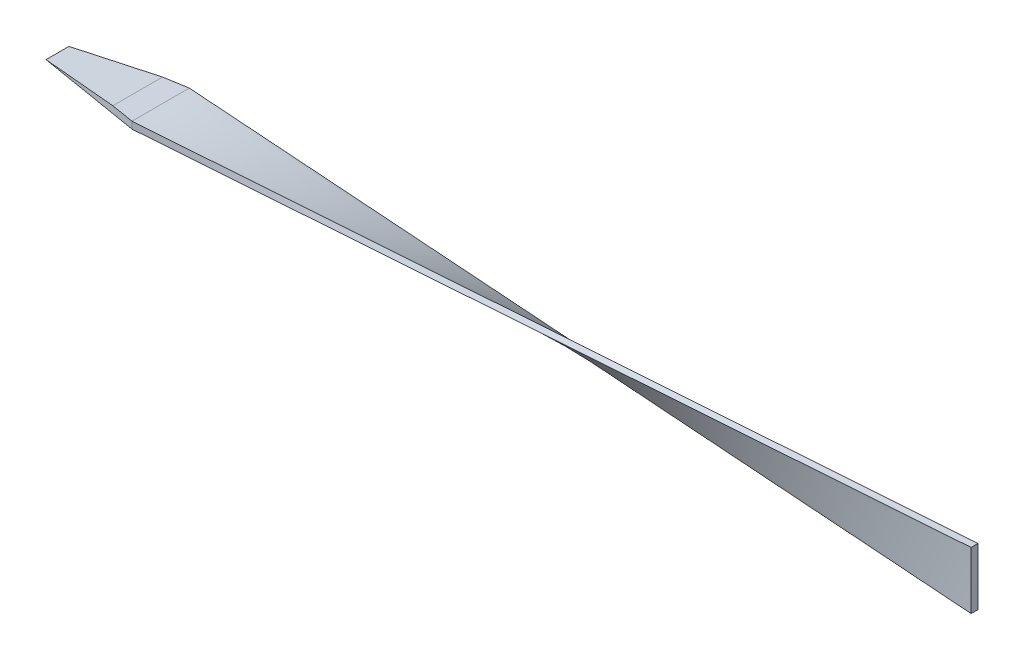
ISO-10303-21;
HEADER;
FILE_DESCRIPTION(('STEP AP214'),'2;1');
FILE_NAME('part.step','',(''),(''),'','','');
FILE_SCHEMA(('AUTOMOTIVE_DESIGN { 1 0 10303 214 1 1 1 1 }'));
ENDSEC;
DATA;
#1=APPLICATION_CONTEXT('core data for automotive mechanical design processes');
#2=APPLICATION_PROTOCOL_DEFINITION('international standard','automotive_design',2000,#1);
#3=PRODUCT_CONTEXT('',#1,'mechanical');
#4=PRODUCT('Part','Part','',(#3));
#5=PRODUCT_RELATED_PRODUCT_CATEGORY('part','',(#4));
#6=PRODUCT_DEFINITION_FORMATION('','',#4);
#7=PRODUCT_DEFINITION_CONTEXT('part definition',#1,'design');
#8=PRODUCT_DEFINITION('design','',#6,#7);
#9=PRODUCT_DEFINITION_SHAPE('','',#8);
#10=(LENGTH_UNIT() NAMED_UNIT(*) SI_UNIT(.MILLI.,.METRE.));
#11=(NAMED_UNIT(*) PLANE_ANGLE_UNIT() SI_UNIT($,.RADIAN.));
#12=(NAMED_UNIT(*) SI_UNIT($,.STERADIAN.) SOLID_ANGLE_UNIT());
#13=UNCERTAINTY_MEASURE_WITH_UNIT(LENGTH_MEASURE(1.E-05),#10,'distance_accuracy_value','');
#14=(GEOMETRIC_REPRESENTATION_CONTEXT(3) GLOBAL_UNCERTAINTY_ASSIGNED_CONTEXT((#13)) GLOBAL_UNIT_ASSIGNED_CONTEXT((#10,
#11,#12)) REPRESENTATION_CONTEXT('',''));
#15=CARTESIAN_POINT('',(0.,0.,0.));
#16=DIRECTION('',(0.,0.,1.));
#17=DIRECTION('',(1.,0.,0.));
#18=AXIS2_PLACEMENT_3D('',#15,#16,#17);
#19=CARTESIAN_POINT('',(0.,0.06,0.));
#20=DIRECTION('',(0.,1.,0.));
#21=DIRECTION('',(0.,0.,1.));
#22=AXIS2_PLACEMENT_3D('',#19,#20,#21);
#23=PLANE('',#22);
#24=DIRECTION('',(0.,0.,1.));
#25=VECTOR('',#24,1.);
#26=CARTESIAN_POINT('',(-7.1,0.06,0.));
#27=LINE('',#26,#25);
#28=CARTESIAN_POINT('',(-7.10000000000001,0.0600000000000002,-0.249999999999999));
#29=VERTEX_POINT('',#28);
#30=CARTESIAN_POINT('',(-7.10000000000002,0.0599999999999997,0.249999999999998));
#31=VERTEX_POINT('',#30);
#32=EDGE_CURVE('E122',#29,#31,#27,.T.);
#33=ORIENTED_EDGE('',*,*,#32,.F.);
#34=DIRECTION('',(0.986393923832144,0.,-0.164398987305357));
#35=VECTOR('',#34,1.);
#36=CARTESIAN_POINT('',(-8.,0.06,-0.0999999999999998));
#37=LINE('',#36,#35);
#38=CARTESIAN_POINT('',(-7.30000000000001,0.0599999999999994,-0.216666666666664));
#39=VERTEX_POINT('',#38);
#40=EDGE_CURVE('E110',#39,#29,#37,.T.);
#41=ORIENTED_EDGE('',*,*,#40,.F.);
#42=DIRECTION('',(0.,0.,1.));
#43=VECTOR('',#42,1.);
#44=CARTESIAN_POINT('',(-7.3,0.06,-1.));
#45=LINE('',#44,#43);
#46=CARTESIAN_POINT('',(-7.3,0.06,0.216666666666666));
#47=VERTEX_POINT('',#46);
#48=EDGE_CURVE('E120',#39,#47,#45,.T.);
#49=ORIENTED_EDGE('',*,*,#48,.T.);
#50=DIRECTION('',(0.986393923832144,0.,0.164398987305357));
#51=VECTOR('',#50,1.);
#52=CARTESIAN_POINT('',(-8.,0.06,0.0999999999999998));
#53=LINE('',#52,#51);
#54=EDGE_CURVE('E71',#47,#31,#53,.T.);
#55=ORIENTED_EDGE('',*,*,#54,.T.);
#56=EDGE_LOOP('',(#33,#41,#49,#55));
#57=FACE_BOUND('',#56,.T.);
#58=ADVANCED_FACE('F51',(#57),#23,.T.);
#59=CARTESIAN_POINT('',(0.,0.,0.));
#60=DIRECTION('',(0.,1.,0.));
#61=DIRECTION('',(0.,0.,1.));
#62=AXIS2_PLACEMENT_3D('',#59,#60,#61);
#63=PLANE('',#62);
#64=DIRECTION('',(0.986393923832144,0.,-0.164398987305357));
#65=VECTOR('',#64,1.);
#66=CARTESIAN_POINT('',(-8.,0.,-0.0999999999999998));
#67=LINE('',#66,#65);
#68=CARTESIAN_POINT('',(-8.,0.,-0.0999999999999998));
#69=VERTEX_POINT('',#68);
#70=CARTESIAN_POINT('',(-7.1,0.,-0.249999999999999));
#71=VERTEX_POINT('',#70);
#72=EDGE_CURVE('E113',#69,#71,#67,.T.);
#73=ORIENTED_EDGE('',*,*,#72,.T.);
#74=DIRECTION('',(0.,0.,1.));
#75=VECTOR('',#74,1.);
#76=CARTESIAN_POINT('',(-7.1,0.,0.));
#77=LINE('',#76,#75);
#78=CARTESIAN_POINT('',(-7.10000000000001,0.,0.249999999999999));
#79=VERTEX_POINT('',#78);
#80=EDGE_CURVE('E143',#71,#79,#77,.T.);
#81=ORIENTED_EDGE('',*,*,#80,.T.);
#82=DIRECTION('',(0.986393923832144,0.,0.164398987305357));
#83=VECTOR('',#82,1.);
#84=CARTESIAN_POINT('',(-8.,0.,0.0999999999999998));
#85=LINE('',#84,#83);
#86=CARTESIAN_POINT('',(-8.,0.,0.0999999999999998));
#87=VERTEX_POINT('',#86);
#88=EDGE_CURVE('E89',#87,#79,#85,.T.);
#89=ORIENTED_EDGE('',*,*,#88,.F.);
#90=DIRECTION('',(0.,0.,-1.));
#91=VECTOR('',#90,1.);
#92=CARTESIAN_POINT('',(-8.,0.,0.));
#93=LINE('',#92,#91);
#94=EDGE_CURVE('E127',#87,#69,#93,.T.);
#95=ORIENTED_EDGE('',*,*,#94,.T.);
#96=EDGE_LOOP('',(#73,#81,#89,#95));
#97=FACE_BOUND('',#96,.T.);
#98=ADVANCED_FACE('F53',(#97),#63,.F.);
#99=CARTESIAN_POINT('',(-7.3,0.06,-1.));
#100=DIRECTION('',(-0.0854011413464358,0.996346649041751,0.));
#101=DIRECTION('',(-0.996346649041751,-0.0854011413464358,0.));
#102=AXIS2_PLACEMENT_3D('',#99,#100,#101);
#103=PLANE('',#102);
#104=ORIENTED_EDGE('',*,*,#48,.F.);
#105=DIRECTION('',(-0.982887157648091,-0.0842474706555507,0.163814526274681));
#106=VECTOR('',#105,1.);
#107=CARTESIAN_POINT('',(-7.17387456461259,0.0708107516046353,-0.237687572564568));
#108=LINE('',#107,#106);
#109=EDGE_CURVE('E13',#39,#69,#108,.T.);
#110=ORIENTED_EDGE('',*,*,#109,.T.);
#111=ORIENTED_EDGE('',*,*,#94,.F.);
#112=DIRECTION('',(-0.982887157648091,-0.0842474706555507,-0.163814526274681));
#113=VECTOR('',#112,1.);
#114=CARTESIAN_POINT('',(-7.49589695283577,0.043208832614077,0.184017174527372));
#115=LINE('',#114,#113);
#116=EDGE_CURVE('E62',#47,#87,#115,.T.);
#117=ORIENTED_EDGE('',*,*,#116,.F.);
#118=EDGE_LOOP('',(#104,#110,#111,#117));
#119=FACE_BOUND('',#118,.T.);
#120=ADVANCED_FACE('F125',(#119),#103,.T.);
#121=CARTESIAN_POINT('',(-8.,0.06,0.0999999999999998));
#122=DIRECTION('',(0.164398987305357,0.,-0.986393923832144));
#123=DIRECTION('',(-0.986393923832144,0.,-0.164398987305357));
#124=AXIS2_PLACEMENT_3D('',#121,#122,#123);
#125=PLANE('',#124);
#126=ORIENTED_EDGE('',*,*,#116,.T.);
#127=ORIENTED_EDGE('',*,*,#88,.T.);
#128=DIRECTION('',(0.,1.,0.));
#129=VECTOR('',#128,1.);
#130=CARTESIAN_POINT('',(-7.1,0.06,0.249999999999999));
#131=LINE('',#130,#129);
#132=EDGE_CURVE('E55',#31,#79,#131,.F.);
#133=ORIENTED_EDGE('',*,*,#132,.F.);
#134=ORIENTED_EDGE('',*,*,#54,.F.);
#135=EDGE_LOOP('',(#126,#127,#133,#134));
#136=FACE_BOUND('',#135,.T.);
#137=ADVANCED_FACE('F261',(#136),#125,.F.);
#138=CARTESIAN_POINT('',(-8.,0.06,-0.0999999999999998));
#139=DIRECTION('',(-0.164398987305357,0.,-0.986393923832144));
#140=DIRECTION('',(-0.986393923832144,0.,0.164398987305357));
#141=AXIS2_PLACEMENT_3D('',#138,#139,#140);
#142=PLANE('',#141);
#143=ORIENTED_EDGE('',*,*,#40,.T.);
#144=DIRECTION('',(0.,1.,0.));
#145=VECTOR('',#144,1.);
#146=CARTESIAN_POINT('',(-7.1,0.06,-0.249999999999999));
#147=LINE('',#146,#145);
#148=EDGE_CURVE('E146',#29,#71,#147,.F.);
#149=ORIENTED_EDGE('',*,*,#148,.T.);
#150=ORIENTED_EDGE('',*,*,#72,.F.);
#151=ORIENTED_EDGE('',*,*,#109,.F.);
#152=EDGE_LOOP('',(#143,#149,#150,#151));
#153=FACE_BOUND('',#152,.T.);
#154=ADVANCED_FACE('F109',(#153),#142,.T.);
#155=CARTESIAN_POINT('',(0.,0.,0.));
#156=DIRECTION('',(-1.,0.,0.));
#157=DIRECTION('',(0.,0.,1.));
#158=AXIS2_PLACEMENT_3D('',#155,#156,#157);
#159=PLANE('',#158);
#160=DIRECTION('',(0.,-1.,0.));
#161=VECTOR('',#160,1.);
#162=CARTESIAN_POINT('',(0.,0.28,-0.03));
#163=LINE('',#162,#161);
#164=CARTESIAN_POINT('',(0.,0.28,-0.03));
#165=VERTEX_POINT('',#164);
#166=CARTESIAN_POINT('',(0.,-0.22,-0.03));
#167=VERTEX_POINT('',#166);
#168=EDGE_CURVE('E181',#165,#167,#163,.T.);
#169=ORIENTED_EDGE('',*,*,#168,.F.);
#170=DIRECTION('',(0.,0.,-1.));
#171=VECTOR('',#170,1.);
#172=CARTESIAN_POINT('',(0.,0.28,-0.03));
#173=LINE('',#172,#171);
#174=CARTESIAN_POINT('',(0.,0.28,0.03));
#175=VERTEX_POINT('',#174);
#176=EDGE_CURVE('E177',#175,#165,#173,.T.);
#177=ORIENTED_EDGE('',*,*,#176,.F.);
#178=DIRECTION('',(0.,1.,0.));
#179=VECTOR('',#178,1.);
#180=CARTESIAN_POINT('',(0.,0.28,0.03));
#181=LINE('',#180,#179);
#182=CARTESIAN_POINT('',(0.,-0.22,0.03));
#183=VERTEX_POINT('',#182);
#184=EDGE_CURVE('E237',#183,#175,#181,.T.);
#185=ORIENTED_EDGE('',*,*,#184,.F.);
#186=DIRECTION('',(0.,0.,1.));
#187=VECTOR('',#186,1.);
#188=CARTESIAN_POINT('',(0.,-0.22,-0.03));
#189=LINE('',#188,#187);
#190=EDGE_CURVE('E98',#167,#183,#189,.T.);
#191=ORIENTED_EDGE('',*,*,#190,.F.);
#192=EDGE_LOOP('',(#169,#177,#185,#191));
#193=FACE_BOUND('',#192,.T.);
#194=ADVANCED_FACE('F201',(#193),#159,.F.);
#195=CARTESIAN_POINT('',(0.,0.28,-0.03));
#196=CARTESIAN_POINT('',(-7.1,0.06,0.249999999999999));
#197=CARTESIAN_POINT('',(0.,0.196666666666667,-0.03));
#198=CARTESIAN_POINT('',(-7.1,0.06,0.166666666666666));
#199=CARTESIAN_POINT('',(0.,0.113333333333334,-0.03));
#200=CARTESIAN_POINT('',(-7.1,0.06,0.083333333333333));
#201=CARTESIAN_POINT('',(0.,-0.0533333333333329,-0.03));
#202=CARTESIAN_POINT('',(-7.1,0.06,-0.0833333333333332));
#203=CARTESIAN_POINT('',(0.,-0.136666666666666,-0.03));
#204=CARTESIAN_POINT('',(-7.1,0.06,-0.166666666666666));
#205=CARTESIAN_POINT('',(0.,-0.22,-0.03));
#206=CARTESIAN_POINT('',(-7.1,0.06,-0.249999999999999));
#207=B_SPLINE_SURFACE_WITH_KNOTS('',3,1,((#195,#196),(#197,#198),(#199,#200),(#201,#202),(#203,
#204),(#205,#206)),.UNSPECIFIED.,.F.,.F.,.F.,(4,2,4),(2,2),(0.,0.5,1.),(0.,1.),.UNSPECIFIED.);
#208=DIRECTION('',(-0.998744680735361,0.0393871141698452,-0.0309470182763069));
#209=VECTOR('',#208,1.);
#210=CARTESIAN_POINT('',(-3.55,-0.08,-0.14));
#211=LINE('',#210,#209);
#212=EDGE_CURVE('E164',#167,#29,#211,.T.);
#213=DIRECTION('',(0.998744680735361,0.030947018276307,-0.0393871141698451));
#214=VECTOR('',#213,1.);
#215=CARTESIAN_POINT('',(-3.55,0.17,0.11));
#216=LINE('',#215,#214);
#217=EDGE_CURVE('E174',#31,#165,#216,.T.);
#218=ORIENTED_EDGE('',*,*,#168,.T.);
#219=ORIENTED_EDGE('',*,*,#212,.T.);
#220=ORIENTED_EDGE('',*,*,#32,.T.);
#221=ORIENTED_EDGE('',*,*,#217,.T.);
#222=EDGE_LOOP('',(#218,#219,#220,#221));
#223=FACE_BOUND('',#222,.T.);
#224=ADVANCED_FACE('F188',(#223),#207,.T.);
#225=CARTESIAN_POINT('',(0.,-0.22,-0.03));
#226=CARTESIAN_POINT('',(-7.1,0.06,-0.249999999999999));
#227=CARTESIAN_POINT('',(0.,-0.22,-0.02));
#228=CARTESIAN_POINT('',(-7.1,0.05,-0.249999999999999));
#229=CARTESIAN_POINT('',(0.,-0.22,-0.01));
#230=CARTESIAN_POINT('',(-7.1,0.04,-0.249999999999999));
#231=CARTESIAN_POINT('',(0.,-0.22,0.00999999999999999));
#232=CARTESIAN_POINT('',(-7.1,0.02,-0.249999999999999));
#233=CARTESIAN_POINT('',(0.,-0.22,0.02));
#234=CARTESIAN_POINT('',(-7.1,0.00999999999999998,-0.249999999999999));
#235=CARTESIAN_POINT('',(0.,-0.22,0.03));
#236=CARTESIAN_POINT('',(-7.1,0.,-0.249999999999999));
#237=B_SPLINE_SURFACE_WITH_KNOTS('',3,1,((#225,#226),(#227,#228),(#229,#230),(#231,#232),(#233,
#234),(#235,#236)),.UNSPECIFIED.,.F.,.F.,.F.,(4,2,4),(2,2),(0.,0.5,1.),(0.,1.),.UNSPECIFIED.);
#238=DIRECTION('',(-0.998744680735361,0.0309470182763069,-0.0393871141698451));
#239=VECTOR('',#238,1.);
#240=CARTESIAN_POINT('',(-3.55,-0.11,-0.11));
#241=LINE('',#240,#239);
#242=EDGE_CURVE('E156',#183,#71,#241,.T.);
#243=ORIENTED_EDGE('',*,*,#190,.T.);
#244=ORIENTED_EDGE('',*,*,#242,.T.);
#245=ORIENTED_EDGE('',*,*,#148,.F.);
#246=ORIENTED_EDGE('',*,*,#212,.F.);
#247=EDGE_LOOP('',(#243,#244,#245,#246));
#248=FACE_BOUND('',#247,.T.);
#249=ADVANCED_FACE('F200',(#248),#237,.T.);
#250=CARTESIAN_POINT('',(0.,0.28,0.03));
#251=CARTESIAN_POINT('',(-7.1,0.,0.249999999999999));
#252=CARTESIAN_POINT('',(0.,0.28,0.02));
#253=CARTESIAN_POINT('',(-7.1,0.01,0.249999999999999));
#254=CARTESIAN_POINT('',(0.,0.28,0.00999999999999999));
#255=CARTESIAN_POINT('',(-7.1,0.02,0.249999999999999));
#256=CARTESIAN_POINT('',(0.,0.28,-0.01));
#257=CARTESIAN_POINT('',(-7.1,0.04,0.249999999999999));
#258=CARTESIAN_POINT('',(0.,0.28,-0.02));
#259=CARTESIAN_POINT('',(-7.1,0.05,0.249999999999999));
#260=CARTESIAN_POINT('',(0.,0.28,-0.03));
#261=CARTESIAN_POINT('',(-7.1,0.06,0.249999999999999));
#262=B_SPLINE_SURFACE_WITH_KNOTS('',3,1,((#250,#251),(#252,#253),(#254,#255),(#256,#257),(#258,
#259),(#260,#261)),.UNSPECIFIED.,.F.,.F.,.F.,(4,2,4),(2,2),(0.,0.5,1.),(0.,1.),.UNSPECIFIED.);
#263=DIRECTION('',(-0.998744680735361,-0.0393871141698452,0.0309470182763069));
#264=VECTOR('',#263,1.);
#265=CARTESIAN_POINT('',(-3.55,0.14,0.14));
#266=LINE('',#265,#264);
#267=EDGE_CURVE('E149',#175,#79,#266,.T.);
#268=ORIENTED_EDGE('',*,*,#176,.T.);
#269=ORIENTED_EDGE('',*,*,#217,.F.);
#270=ORIENTED_EDGE('',*,*,#132,.T.);
#271=ORIENTED_EDGE('',*,*,#267,.F.);
#272=EDGE_LOOP('',(#268,#269,#270,#271));
#273=FACE_BOUND('',#272,.T.);
#274=ADVANCED_FACE('F212',(#273),#262,.T.);
#275=CARTESIAN_POINT('',(0.,-0.22,0.03));
#276=CARTESIAN_POINT('',(-7.1,0.,-0.249999999999999));
#277=CARTESIAN_POINT('',(0.,-0.136666666666667,0.03));
#278=CARTESIAN_POINT('',(-7.1,0.,-0.166666666666666));
#279=CARTESIAN_POINT('',(0.,-0.0533333333333345,0.03));
#280=CARTESIAN_POINT('',(-7.1,0.,-0.083333333333333));
#281=CARTESIAN_POINT('',(0.,0.113333333333332,0.03));
#282=CARTESIAN_POINT('',(-7.1,0.,0.0833333333333332));
#283=CARTESIAN_POINT('',(0.,0.196666666666666,0.03));
#284=CARTESIAN_POINT('',(-7.1,0.,0.166666666666666));
#285=CARTESIAN_POINT('',(0.,0.28,0.03));
#286=CARTESIAN_POINT('',(-7.1,0.,0.249999999999999));
#287=B_SPLINE_SURFACE_WITH_KNOTS('',3,1,((#275,#276),(#277,#278),(#279,#280),(#281,#282),(#283,
#284),(#285,#286)),.UNSPECIFIED.,.F.,.F.,.F.,(4,2,4),(2,2),(0.,0.5,1.),(0.,1.),.UNSPECIFIED.);
#288=ORIENTED_EDGE('',*,*,#184,.T.);
#289=ORIENTED_EDGE('',*,*,#267,.T.);
#290=ORIENTED_EDGE('',*,*,#80,.F.);
#291=ORIENTED_EDGE('',*,*,#242,.F.);
#292=EDGE_LOOP('',(#288,#289,#290,#291));
#293=FACE_BOUND('',#292,.T.);
#294=ADVANCED_FACE('F243',(#293),#287,.T.);
#295=CLOSED_SHELL('',(#58,#98,#120,#137,#154,#194,#224,#249,#274,#294));
#296=MANIFOLD_SOLID_BREP('B2',#295);
#297=ADVANCED_BREP_SHAPE_REPRESENTATION('',(#18,#296),#14);
#298=SHAPE_DEFINITION_REPRESENTATION(#9,#297);
ENDSEC;
END-ISO-10303-21;
